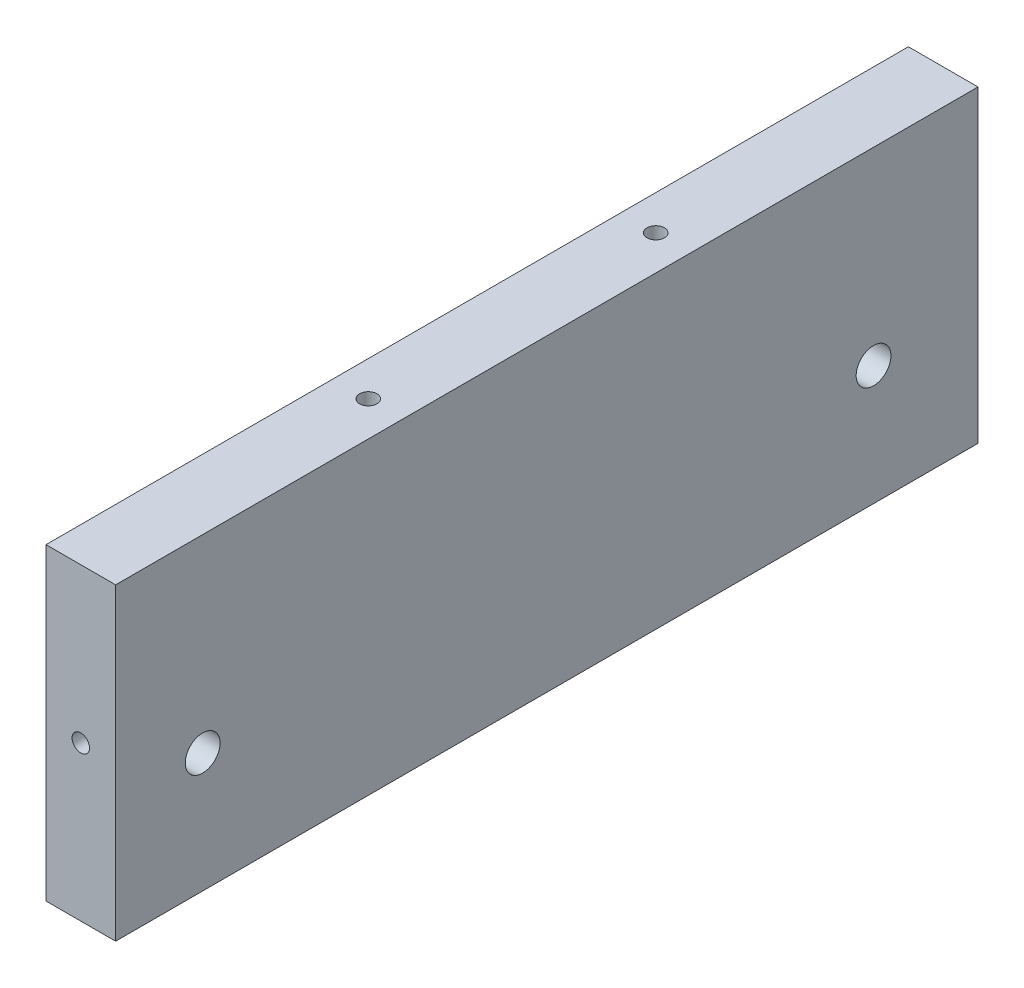
ISO-10303-21;
HEADER;
FILE_DESCRIPTION(('STEP AP214'),'2;1');
FILE_NAME('part.step','',(''),(''),'','','');
FILE_SCHEMA(('AUTOMOTIVE_DESIGN { 1 0 10303 214 1 1 1 1 }'));
ENDSEC;
DATA;
#1=APPLICATION_CONTEXT('core data for automotive mechanical design processes');
#2=APPLICATION_PROTOCOL_DEFINITION('international standard','automotive_design',2000,#1);
#3=PRODUCT_CONTEXT('',#1,'mechanical');
#4=PRODUCT('Part','Part','',(#3));
#5=PRODUCT_RELATED_PRODUCT_CATEGORY('part','',(#4));
#6=PRODUCT_DEFINITION_FORMATION('','',#4);
#7=PRODUCT_DEFINITION_CONTEXT('part definition',#1,'design');
#8=PRODUCT_DEFINITION('design','',#6,#7);
#9=PRODUCT_DEFINITION_SHAPE('','',#8);
#10=(LENGTH_UNIT() NAMED_UNIT(*) SI_UNIT(.MILLI.,.METRE.));
#11=(NAMED_UNIT(*) PLANE_ANGLE_UNIT() SI_UNIT($,.RADIAN.));
#12=(NAMED_UNIT(*) SI_UNIT($,.STERADIAN.) SOLID_ANGLE_UNIT());
#13=UNCERTAINTY_MEASURE_WITH_UNIT(LENGTH_MEASURE(1.E-05),#10,'distance_accuracy_value','');
#14=(GEOMETRIC_REPRESENTATION_CONTEXT(3) GLOBAL_UNCERTAINTY_ASSIGNED_CONTEXT((#13)) GLOBAL_UNIT_ASSIGNED_CONTEXT((#10,
#11,#12)) REPRESENTATION_CONTEXT('',''));
#15=CARTESIAN_POINT('',(0.,0.,0.));
#16=DIRECTION('',(0.,0.,1.));
#17=DIRECTION('',(1.,0.,0.));
#18=AXIS2_PLACEMENT_3D('',#15,#16,#17);
#19=CARTESIAN_POINT('',(-244.004465963194,69.0000000000027,215.014642856048));
#20=DIRECTION('',(1.,0.,0.));
#21=DIRECTION('',(0.,0.,-1.00000000000004));
#22=AXIS2_PLACEMENT_3D('',#19,#20,#21);
#23=PLANE('',#22);
#24=CARTESIAN_POINT('',(-244.004465963193,34.5000000000022,141.425000000005));
#25=DIRECTION('',(-1.,0.,0.));
#26=DIRECTION('',(0.,0.,1.00000000000004));
#27=AXIS2_PLACEMENT_3D('',#24,#25,#26);
#28=CIRCLE('',#27,3.17499999999998);
#29=CARTESIAN_POINT('',(-244.004465963193,34.5000000000021,144.600000000005));
#30=VERTEX_POINT('',#29);
#31=EDGE_CURVE('E266',#30,#30,#28,.T.);
#32=ORIENTED_EDGE('',*,*,#31,.F.);
#33=EDGE_LOOP('',(#32));
#34=FACE_BOUND('',#33,.T.);
#35=CARTESIAN_POINT('',(-244.004465963193,34.5000000000042,19.0499999999996));
#36=DIRECTION('',(-1.,0.,0.));
#37=DIRECTION('',(0.,0.,1.00000000000004));
#38=AXIS2_PLACEMENT_3D('',#35,#36,#37);
#39=CIRCLE('',#38,3.17499999999998);
#40=CARTESIAN_POINT('',(-244.004465963193,34.5000000000041,22.2249999999997));
#41=VERTEX_POINT('',#40);
#42=EDGE_CURVE('E111',#41,#41,#39,.T.);
#43=ORIENTED_EDGE('',*,*,#42,.F.);
#44=EDGE_LOOP('',(#43));
#45=FACE_BOUND('',#44,.T.);
#46=DIRECTION('',(0.,-1.00000000000004,0.));
#47=VECTOR('',#46,1.);
#48=CARTESIAN_POINT('',(-244.004465963193,69.0000000000002,157.300000000006));
#49=LINE('',#48,#47);
#50=CARTESIAN_POINT('',(-244.004465963193,69.0000000000002,157.300000000006));
#51=VERTEX_POINT('',#50);
#52=CARTESIAN_POINT('',(-244.004465963193,12.7000000000015,157.300000000009));
#53=VERTEX_POINT('',#52);
#54=EDGE_CURVE('E142',#51,#53,#49,.T.);
#55=ORIENTED_EDGE('',*,*,#54,.F.);
#56=DIRECTION('',(0.,0.,-1.00000000000004));
#57=VECTOR('',#56,1.);
#58=CARTESIAN_POINT('',(-244.004465963194,69.0000000000027,215.014642856048));
#59=LINE('',#58,#57);
#60=CARTESIAN_POINT('',(-244.004465963193,69.0000000000054,-1.74860126378462E-12));
#61=VERTEX_POINT('',#60);
#62=EDGE_CURVE('E51',#51,#61,#59,.T.);
#63=ORIENTED_EDGE('',*,*,#62,.T.);
#64=DIRECTION('',(0.,-1.00000000000004,0.));
#65=VECTOR('',#64,1.);
#66=CARTESIAN_POINT('',(-244.004465963193,69.0000000000054,-1.74860126378462E-12));
#67=LINE('',#66,#65);
#68=CARTESIAN_POINT('',(-244.004465963193,12.7000000000008,6.93889390390723E-13));
#69=VERTEX_POINT('',#68);
#70=EDGE_CURVE('E138',#61,#69,#67,.T.);
#71=ORIENTED_EDGE('',*,*,#70,.T.);
#72=DIRECTION('',(0.,0.,-1.00000000000004));
#73=VECTOR('',#72,1.);
#74=CARTESIAN_POINT('',(-244.004465963193,12.6999999999971,215.014642856049));
#75=LINE('',#74,#73);
#76=EDGE_CURVE('E74',#53,#69,#75,.T.);
#77=ORIENTED_EDGE('',*,*,#76,.F.);
#78=EDGE_LOOP('',(#55,#63,#71,#77));
#79=FACE_BOUND('',#78,.T.);
#80=ADVANCED_FACE('F34',(#34,#45,#79),#23,.F.);
#81=CARTESIAN_POINT('',(-244.004465963193,12.6999999999971,215.014642856049));
#82=DIRECTION('',(0.,1.00000000000004,0.));
#83=DIRECTION('',(0.,0.,1.00000000000004));
#84=AXIS2_PLACEMENT_3D('',#81,#82,#83);
#85=PLANE('',#84);
#86=CARTESIAN_POINT('',(-237.654465963194,12.7000000000029,26.2166666666679));
#87=DIRECTION('',(0.,1.00000000000004,0.));
#88=DIRECTION('',(0.,0.,1.00000000000004));
#89=AXIS2_PLACEMENT_3D('',#86,#87,#88);
#90=CIRCLE('',#89,1.58749999999999);
#91=CARTESIAN_POINT('',(-237.654465963194,12.7000000000029,27.804166666668));
#92=VERTEX_POINT('',#91);
#93=EDGE_CURVE('E125',#92,#92,#90,.T.);
#94=ORIENTED_EDGE('',*,*,#93,.T.);
#95=EDGE_LOOP('',(#94));
#96=FACE_BOUND('',#95,.T.);
#97=CARTESIAN_POINT('',(-237.654465963191,12.7000000000021,131.08333333334));
#98=DIRECTION('',(0.,1.00000000000004,0.));
#99=DIRECTION('',(0.,0.,1.00000000000004));
#100=AXIS2_PLACEMENT_3D('',#97,#98,#99);
#101=CIRCLE('',#100,1.58749999999999);
#102=CARTESIAN_POINT('',(-237.654465963191,12.7000000000021,132.67083333334));
#103=VERTEX_POINT('',#102);
#104=EDGE_CURVE('E129',#103,#103,#101,.T.);
#105=ORIENTED_EDGE('',*,*,#104,.T.);
#106=EDGE_LOOP('',(#105));
#107=FACE_BOUND('',#106,.T.);
#108=DIRECTION('',(1.,0.,0.));
#109=VECTOR('',#108,1.);
#110=CARTESIAN_POINT('',(-244.004465963193,12.7000000000015,157.300000000009));
#111=LINE('',#110,#109);
#112=CARTESIAN_POINT('',(-231.304465963193,12.7000000000012,157.300000000007));
#113=VERTEX_POINT('',#112);
#114=EDGE_CURVE('E43',#53,#113,#111,.T.);
#115=ORIENTED_EDGE('',*,*,#114,.F.);
#116=ORIENTED_EDGE('',*,*,#76,.T.);
#117=DIRECTION('',(1.,0.,0.));
#118=VECTOR('',#117,1.);
#119=CARTESIAN_POINT('',(-244.004465963193,12.7000000000008,6.93889390390723E-13));
#120=LINE('',#119,#118);
#121=CARTESIAN_POINT('',(-231.304465963193,12.7000000000007,2.4980018054066E-13));
#122=VERTEX_POINT('',#121);
#123=EDGE_CURVE('E136',#69,#122,#120,.T.);
#124=ORIENTED_EDGE('',*,*,#123,.T.);
#125=DIRECTION('',(0.,0.,-1.00000000000004));
#126=VECTOR('',#125,1.);
#127=CARTESIAN_POINT('',(-231.304465963193,12.6999999999967,215.014642856048));
#128=LINE('',#127,#126);
#129=EDGE_CURVE('E135',#113,#122,#128,.T.);
#130=ORIENTED_EDGE('',*,*,#129,.F.);
#131=EDGE_LOOP('',(#115,#116,#124,#130));
#132=FACE_BOUND('',#131,.T.);
#133=ADVANCED_FACE('F178',(#96,#107,#132),#85,.F.);
#134=CARTESIAN_POINT('',(-231.304465963193,69.0000000000003,215.014642856048));
#135=DIRECTION('',(-1.,0.,0.));
#136=DIRECTION('',(0.,0.,1.00000000000004));
#137=AXIS2_PLACEMENT_3D('',#134,#135,#136);
#138=PLANE('',#137);
#139=CARTESIAN_POINT('',(-231.304465963193,34.4999999999998,141.425000000005));
#140=DIRECTION('',(-1.,0.,0.));
#141=DIRECTION('',(0.,0.,1.00000000000004));
#142=AXIS2_PLACEMENT_3D('',#139,#140,#141);
#143=CIRCLE('',#142,3.175);
#144=CARTESIAN_POINT('',(-231.304465963193,34.4999999999997,144.600000000005));
#145=VERTEX_POINT('',#144);
#146=EDGE_CURVE('E264',#145,#145,#143,.T.);
#147=ORIENTED_EDGE('',*,*,#146,.T.);
#148=EDGE_LOOP('',(#147));
#149=FACE_BOUND('',#148,.T.);
#150=CARTESIAN_POINT('',(-231.304465963193,34.5000000000034,19.0499999999996));
#151=DIRECTION('',(-1.,0.,0.));
#152=DIRECTION('',(0.,0.,1.00000000000004));
#153=AXIS2_PLACEMENT_3D('',#150,#151,#152);
#154=CIRCLE('',#153,3.175);
#155=CARTESIAN_POINT('',(-231.304465963193,34.5000000000033,22.2249999999998));
#156=VERTEX_POINT('',#155);
#157=EDGE_CURVE('E106',#156,#156,#154,.T.);
#158=ORIENTED_EDGE('',*,*,#157,.T.);
#159=EDGE_LOOP('',(#158));
#160=FACE_BOUND('',#159,.T.);
#161=DIRECTION('',(0.,1.00000000000004,0.));
#162=VECTOR('',#161,1.);
#163=CARTESIAN_POINT('',(-231.304465963193,69.0000000000002,157.300000000005));
#164=LINE('',#163,#162);
#165=CARTESIAN_POINT('',(-231.304465963193,69.0000000000002,157.300000000005));
#166=VERTEX_POINT('',#165);
#167=EDGE_CURVE('E11',#113,#166,#164,.T.);
#168=ORIENTED_EDGE('',*,*,#167,.F.);
#169=ORIENTED_EDGE('',*,*,#129,.T.);
#170=DIRECTION('',(0.,1.00000000000004,0.));
#171=VECTOR('',#170,1.);
#172=CARTESIAN_POINT('',(-231.304465963193,69.0000000000054,-1.30451205393456E-12));
#173=LINE('',#172,#171);
#174=CARTESIAN_POINT('',(-231.304465963193,69.0000000000054,-1.30451205393456E-12));
#175=VERTEX_POINT('',#174);
#176=EDGE_CURVE('E133',#122,#175,#173,.T.);
#177=ORIENTED_EDGE('',*,*,#176,.T.);
#178=DIRECTION('',(0.,0.,-1.00000000000004));
#179=VECTOR('',#178,1.);
#180=CARTESIAN_POINT('',(-231.304465963193,69.0000000000003,215.014642856048));
#181=LINE('',#180,#179);
#182=EDGE_CURVE('E57',#166,#175,#181,.T.);
#183=ORIENTED_EDGE('',*,*,#182,.F.);
#184=EDGE_LOOP('',(#168,#169,#177,#183));
#185=FACE_BOUND('',#184,.T.);
#186=ADVANCED_FACE('F183',(#149,#160,#185),#138,.F.);
#187=CARTESIAN_POINT('',(-244.004465963194,69.0000000000027,215.014642856048));
#188=DIRECTION('',(0.,-1.00000000000004,0.));
#189=DIRECTION('',(0.,0.,-1.00000000000004));
#190=AXIS2_PLACEMENT_3D('',#187,#188,#189);
#191=PLANE('',#190);
#192=CARTESIAN_POINT('',(-237.654465963192,69.0000000000028,104.866666666671));
#193=DIRECTION('',(0.,-1.00000000000004,0.));
#194=DIRECTION('',(0.,0.,-1.00000000000004));
#195=AXIS2_PLACEMENT_3D('',#192,#193,#194);
#196=CIRCLE('',#195,1.58749999999999);
#197=CARTESIAN_POINT('',(-237.654465963192,69.0000000000028,103.279166666671));
#198=VERTEX_POINT('',#197);
#199=EDGE_CURVE('E38',#198,#198,#196,.T.);
#200=ORIENTED_EDGE('',*,*,#199,.T.);
#201=EDGE_LOOP('',(#200));
#202=FACE_BOUND('',#201,.T.);
#203=CARTESIAN_POINT('',(-237.654465963192,69.0000000000038,52.433333333336));
#204=DIRECTION('',(0.,-1.00000000000004,0.));
#205=DIRECTION('',(0.,0.,-1.00000000000004));
#206=AXIS2_PLACEMENT_3D('',#203,#204,#205);
#207=CIRCLE('',#206,1.58749999999999);
#208=CARTESIAN_POINT('',(-237.654465963192,69.0000000000038,50.8458333333359));
#209=VERTEX_POINT('',#208);
#210=EDGE_CURVE('E117',#209,#209,#207,.T.);
#211=ORIENTED_EDGE('',*,*,#210,.T.);
#212=EDGE_LOOP('',(#211));
#213=FACE_BOUND('',#212,.T.);
#214=DIRECTION('',(-1.,0.,0.));
#215=VECTOR('',#214,1.);
#216=CARTESIAN_POINT('',(-244.004465963193,69.0000000000002,157.300000000006));
#217=LINE('',#216,#215);
#218=EDGE_CURVE('E132',#166,#51,#217,.T.);
#219=ORIENTED_EDGE('',*,*,#218,.F.);
#220=ORIENTED_EDGE('',*,*,#182,.T.);
#221=DIRECTION('',(-1.,0.,0.));
#222=VECTOR('',#221,1.);
#223=CARTESIAN_POINT('',(-244.004465963193,69.0000000000054,-1.74860126378462E-12));
#224=LINE('',#223,#222);
#225=EDGE_CURVE('E130',#175,#61,#224,.T.);
#226=ORIENTED_EDGE('',*,*,#225,.T.);
#227=ORIENTED_EDGE('',*,*,#62,.F.);
#228=EDGE_LOOP('',(#219,#220,#226,#227));
#229=FACE_BOUND('',#228,.T.);
#230=ADVANCED_FACE('F159',(#202,#213,#229),#191,.F.);
#231=CARTESIAN_POINT('',(0.,0.,0.));
#232=DIRECTION('',(0.,0.,1.00000000000004));
#233=DIRECTION('',(1.,0.,0.));
#234=AXIS2_PLACEMENT_3D('',#231,#232,#233);
#235=PLANE('',#234);
#236=ORIENTED_EDGE('',*,*,#70,.F.);
#237=ORIENTED_EDGE('',*,*,#225,.F.);
#238=ORIENTED_EDGE('',*,*,#176,.F.);
#239=ORIENTED_EDGE('',*,*,#123,.F.);
#240=EDGE_LOOP('',(#236,#237,#238,#239));
#241=FACE_BOUND('',#240,.T.);
#242=ADVANCED_FACE('F194',(#241),#235,.F.);
#243=CARTESIAN_POINT('',(8.88178419700125E-13,-2.55351295663786E-12,157.300000000007));
#244=DIRECTION('',(0.,0.,1.00000000000004));
#245=DIRECTION('',(1.,0.,0.));
#246=AXIS2_PLACEMENT_3D('',#243,#244,#245);
#247=PLANE('',#246);
#248=CARTESIAN_POINT('',(-237.654465963193,40.8500000000015,157.300000000006));
#249=DIRECTION('',(0.,0.,1.00000000000004));
#250=DIRECTION('',(1.,0.,0.));
#251=AXIS2_PLACEMENT_3D('',#248,#249,#250);
#252=CIRCLE('',#251,1.58749999999999);
#253=CARTESIAN_POINT('',(-236.066965963193,40.8500000000015,157.300000000006));
#254=VERTEX_POINT('',#253);
#255=EDGE_CURVE('E121',#254,#254,#252,.T.);
#256=ORIENTED_EDGE('',*,*,#255,.F.);
#257=EDGE_LOOP('',(#256));
#258=FACE_BOUND('',#257,.T.);
#259=ORIENTED_EDGE('',*,*,#218,.T.);
#260=ORIENTED_EDGE('',*,*,#54,.T.);
#261=ORIENTED_EDGE('',*,*,#114,.T.);
#262=ORIENTED_EDGE('',*,*,#167,.T.);
#263=EDGE_LOOP('',(#259,#260,#261,#262));
#264=FACE_BOUND('',#263,.T.);
#265=ADVANCED_FACE('F36',(#258,#264),#247,.T.);
#266=CARTESIAN_POINT('',(-237.654465963194,8.32667268468867E-13,131.08333333334));
#267=DIRECTION('',(0.,-1.00000000000004,0.));
#268=DIRECTION('',(0.,0.,-1.00000000000004));
#269=AXIS2_PLACEMENT_3D('',#266,#267,#268);
#270=CYLINDRICAL_SURFACE('',#269,1.58749999999999);
#271=CARTESIAN_POINT('',(-237.654465963194,31.7499999999997,131.08333333334));
#272=DIRECTION('',(0.,-1.00000000000004,0.));
#273=DIRECTION('',(0.,0.,-1.00000000000004));
#274=AXIS2_PLACEMENT_3D('',#271,#272,#273);
#275=CIRCLE('',#274,1.58749999999999);
#276=CARTESIAN_POINT('',(-237.654465963194,31.7499999999998,129.49583333334));
#277=VERTEX_POINT('',#276);
#278=EDGE_CURVE('E126',#277,#277,#275,.T.);
#279=ORIENTED_EDGE('',*,*,#278,.F.);
#280=EDGE_LOOP('',(#279));
#281=FACE_BOUND('',#280,.T.);
#282=ORIENTED_EDGE('',*,*,#104,.F.);
#283=EDGE_LOOP('',(#282));
#284=FACE_BOUND('',#283,.T.);
#285=ADVANCED_FACE('F203',(#281,#284),#270,.F.);
#286=CARTESIAN_POINT('',(-237.654465963194,31.7499999999997,131.08333333334));
#287=DIRECTION('',(0.,-1.00000000000004,0.));
#288=DIRECTION('',(0.,0.,-1.00000000000004));
#289=AXIS2_PLACEMENT_3D('',#286,#287,#288);
#290=CONICAL_SURFACE('',#289,1.58749999999999,1.02974425867665);
#291=CARTESIAN_POINT('',(-237.654465963194,32.7038662327058,131.083333333339));
#292=VERTEX_POINT('',#291);
#293=VERTEX_LOOP('',#292);
#294=FACE_BOUND('',#293,.T.);
#295=ORIENTED_EDGE('',*,*,#278,.T.);
#296=EDGE_LOOP('',(#295));
#297=FACE_BOUND('',#296,.T.);
#298=ADVANCED_FACE('F199',(#294,#297),#290,.F.);
#299=CARTESIAN_POINT('',(-237.654465963194,1.4432899320127E-12,26.2166666666683));
#300=DIRECTION('',(0.,-1.00000000000004,0.));
#301=DIRECTION('',(0.,0.,-1.00000000000004));
#302=AXIS2_PLACEMENT_3D('',#299,#300,#301);
#303=CYLINDRICAL_SURFACE('',#302,1.58749999999999);
#304=CARTESIAN_POINT('',(-237.654465963194,31.7500000000036,26.2166666666675));
#305=DIRECTION('',(0.,-1.00000000000004,0.));
#306=DIRECTION('',(0.,0.,-1.00000000000004));
#307=AXIS2_PLACEMENT_3D('',#304,#305,#306);
#308=CIRCLE('',#307,1.58749999999999);
#309=CARTESIAN_POINT('',(-237.654465963194,31.7500000000036,24.6291666666674));
#310=VERTEX_POINT('',#309);
#311=EDGE_CURVE('E122',#310,#310,#308,.T.);
#312=ORIENTED_EDGE('',*,*,#311,.F.);
#313=EDGE_LOOP('',(#312));
#314=FACE_BOUND('',#313,.T.);
#315=ORIENTED_EDGE('',*,*,#93,.F.);
#316=EDGE_LOOP('',(#315));
#317=FACE_BOUND('',#316,.T.);
#318=ADVANCED_FACE('F202',(#314,#317),#303,.F.);
#319=CARTESIAN_POINT('',(-237.654465963194,31.7500000000036,26.2166666666675));
#320=DIRECTION('',(0.,-1.00000000000004,0.));
#321=DIRECTION('',(0.,0.,-1.00000000000004));
#322=AXIS2_PLACEMENT_3D('',#319,#320,#321);
#323=CONICAL_SURFACE('',#322,1.58749999999999,1.02974425867665);
#324=CARTESIAN_POINT('',(-237.654465963194,32.7038662327091,26.2166666666676));
#325=VERTEX_POINT('',#324);
#326=VERTEX_LOOP('',#325);
#327=FACE_BOUND('',#326,.T.);
#328=ORIENTED_EDGE('',*,*,#311,.T.);
#329=EDGE_LOOP('',(#328));
#330=FACE_BOUND('',#329,.T.);
#331=ADVANCED_FACE('F208',(#327,#330),#323,.F.);
#332=CARTESIAN_POINT('',(-237.654465963193,40.8499999999991,138.250000000007));
#333=DIRECTION('',(0.,0.,1.00000000000004));
#334=DIRECTION('',(1.,0.,0.));
#335=AXIS2_PLACEMENT_3D('',#332,#333,#334);
#336=CONICAL_SURFACE('',#335,1.58749999999999,1.02974425867666);
#337=CARTESIAN_POINT('',(-237.654465963193,40.8499999999991,137.2961337673));
#338=VERTEX_POINT('',#337);
#339=VERTEX_LOOP('',#338);
#340=FACE_BOUND('',#339,.T.);
#341=CARTESIAN_POINT('',(-237.654465963193,40.8499999999991,138.250000000007));
#342=DIRECTION('',(0.,0.,1.00000000000004));
#343=DIRECTION('',(1.,0.,0.));
#344=AXIS2_PLACEMENT_3D('',#341,#342,#343);
#345=CIRCLE('',#344,1.58749999999999);
#346=CARTESIAN_POINT('',(-236.066965963193,40.8499999999991,138.250000000007));
#347=VERTEX_POINT('',#346);
#348=EDGE_CURVE('E118',#347,#347,#345,.T.);
#349=ORIENTED_EDGE('',*,*,#348,.T.);
#350=EDGE_LOOP('',(#349));
#351=FACE_BOUND('',#350,.T.);
#352=ADVANCED_FACE('F173',(#340,#351),#336,.F.);
#353=CARTESIAN_POINT('',(-237.654465963193,40.8499999999985,170.000000000008));
#354=DIRECTION('',(0.,0.,1.00000000000004));
#355=DIRECTION('',(1.,0.,0.));
#356=AXIS2_PLACEMENT_3D('',#353,#354,#355);
#357=CYLINDRICAL_SURFACE('',#356,1.58749999999999);
#358=ORIENTED_EDGE('',*,*,#255,.T.);
#359=EDGE_LOOP('',(#358));
#360=FACE_BOUND('',#359,.T.);
#361=ORIENTED_EDGE('',*,*,#348,.F.);
#362=EDGE_LOOP('',(#361));
#363=FACE_BOUND('',#362,.T.);
#364=ADVANCED_FACE('F164',(#360,#363),#357,.F.);
#365=CARTESIAN_POINT('',(-237.654465963193,88.0500000000045,52.4333333333351));
#366=DIRECTION('',(0.,1.00000000000004,0.));
#367=DIRECTION('',(0.,0.,1.00000000000005));
#368=AXIS2_PLACEMENT_3D('',#365,#366,#367);
#369=CYLINDRICAL_SURFACE('',#368,1.58749999999999);
#370=CARTESIAN_POINT('',(-237.654465963192,56.3000000000041,52.4333333333359));
#371=DIRECTION('',(0.,1.00000000000004,0.));
#372=DIRECTION('',(0.,0.,1.00000000000005));
#373=AXIS2_PLACEMENT_3D('',#370,#371,#372);
#374=CIRCLE('',#373,1.58749999999999);
#375=CARTESIAN_POINT('',(-237.654465963192,56.3000000000041,54.020833333336));
#376=VERTEX_POINT('',#375);
#377=EDGE_CURVE('E109',#376,#376,#374,.T.);
#378=ORIENTED_EDGE('',*,*,#377,.F.);
#379=EDGE_LOOP('',(#378));
#380=FACE_BOUND('',#379,.T.);
#381=ORIENTED_EDGE('',*,*,#210,.F.);
#382=EDGE_LOOP('',(#381));
#383=FACE_BOUND('',#382,.T.);
#384=ADVANCED_FACE('F161',(#380,#383),#369,.F.);
#385=CARTESIAN_POINT('',(-237.654465963192,56.3000000000041,52.4333333333359));
#386=DIRECTION('',(0.,1.00000000000004,0.));
#387=DIRECTION('',(0.,0.,1.00000000000005));
#388=AXIS2_PLACEMENT_3D('',#385,#386,#387);
#389=CONICAL_SURFACE('',#388,1.58749999999999,1.02974425867665);
#390=CARTESIAN_POINT('',(-237.654465963192,55.3461337672982,52.4333333333355));
#391=VERTEX_POINT('',#390);
#392=VERTEX_LOOP('',#391);
#393=FACE_BOUND('',#392,.T.);
#394=ORIENTED_EDGE('',*,*,#377,.T.);
#395=EDGE_LOOP('',(#394));
#396=FACE_BOUND('',#395,.T.);
#397=ADVANCED_FACE('F163',(#393,#396),#389,.F.);
#398=CARTESIAN_POINT('',(-237.654465963192,88.0500000000023,104.866666666671));
#399=DIRECTION('',(0.,1.00000000000004,0.));
#400=DIRECTION('',(0.,0.,1.00000000000005));
#401=AXIS2_PLACEMENT_3D('',#398,#399,#400);
#402=CYLINDRICAL_SURFACE('',#401,1.58749999999999);
#403=CARTESIAN_POINT('',(-237.654465963192,56.3000000000023,104.866666666672));
#404=DIRECTION('',(0.,1.00000000000004,0.));
#405=DIRECTION('',(0.,0.,1.00000000000005));
#406=AXIS2_PLACEMENT_3D('',#403,#404,#405);
#407=CIRCLE('',#406,1.58749999999999);
#408=CARTESIAN_POINT('',(-237.654465963192,56.3000000000023,106.454166666672));
#409=VERTEX_POINT('',#408);
#410=EDGE_CURVE('E104',#409,#409,#407,.T.);
#411=ORIENTED_EDGE('',*,*,#410,.F.);
#412=EDGE_LOOP('',(#411));
#413=FACE_BOUND('',#412,.T.);
#414=ORIENTED_EDGE('',*,*,#199,.F.);
#415=EDGE_LOOP('',(#414));
#416=FACE_BOUND('',#415,.T.);
#417=ADVANCED_FACE('F100',(#413,#416),#402,.F.);
#418=CARTESIAN_POINT('',(-237.654465963192,56.3000000000023,104.866666666672));
#419=DIRECTION('',(0.,1.00000000000004,0.));
#420=DIRECTION('',(0.,0.,1.00000000000005));
#421=AXIS2_PLACEMENT_3D('',#418,#419,#420);
#422=CONICAL_SURFACE('',#421,1.58749999999999,1.02974425867665);
#423=CARTESIAN_POINT('',(-237.654465963192,55.3461337672958,104.866666666672));
#424=VERTEX_POINT('',#423);
#425=VERTEX_LOOP('',#424);
#426=FACE_BOUND('',#425,.T.);
#427=ORIENTED_EDGE('',*,*,#410,.T.);
#428=EDGE_LOOP('',(#427));
#429=FACE_BOUND('',#428,.T.);
#430=ADVANCED_FACE('F96',(#426,#429),#422,.F.);
#431=CARTESIAN_POINT('',(-244.004465963193,34.5000000000042,19.0499999999996));
#432=DIRECTION('',(-1.,0.,0.));
#433=DIRECTION('',(0.,0.,1.00000000000004));
#434=AXIS2_PLACEMENT_3D('',#431,#432,#433);
#435=CYLINDRICAL_SURFACE('',#434,3.17499999999999);
#436=ORIENTED_EDGE('',*,*,#157,.F.);
#437=EDGE_LOOP('',(#436));
#438=FACE_BOUND('',#437,.T.);
#439=ORIENTED_EDGE('',*,*,#42,.T.);
#440=EDGE_LOOP('',(#439));
#441=FACE_BOUND('',#440,.T.);
#442=ADVANCED_FACE('F99',(#438,#441),#435,.F.);
#443=CARTESIAN_POINT('',(-244.004465963193,34.5000000000022,141.425000000005));
#444=DIRECTION('',(-1.,0.,0.));
#445=DIRECTION('',(0.,0.,1.00000000000004));
#446=AXIS2_PLACEMENT_3D('',#443,#444,#445);
#447=CYLINDRICAL_SURFACE('',#446,3.17499999999999);
#448=ORIENTED_EDGE('',*,*,#146,.F.);
#449=EDGE_LOOP('',(#448));
#450=FACE_BOUND('',#449,.T.);
#451=ORIENTED_EDGE('',*,*,#31,.T.);
#452=EDGE_LOOP('',(#451));
#453=FACE_BOUND('',#452,.T.);
#454=ADVANCED_FACE('F251',(#450,#453),#447,.F.);
#455=CLOSED_SHELL('',(#80,#133,#186,#230,#242,#265,#285,#298,#318,#331,#352,#364,#384,#397,#417,
#430,#442,#454));
#456=MANIFOLD_SOLID_BREP('B2',#455);
#457=ADVANCED_BREP_SHAPE_REPRESENTATION('',(#18,#456),#14);
#458=SHAPE_DEFINITION_REPRESENTATION(#9,#457);
ENDSEC;
END-ISO-10303-21;
